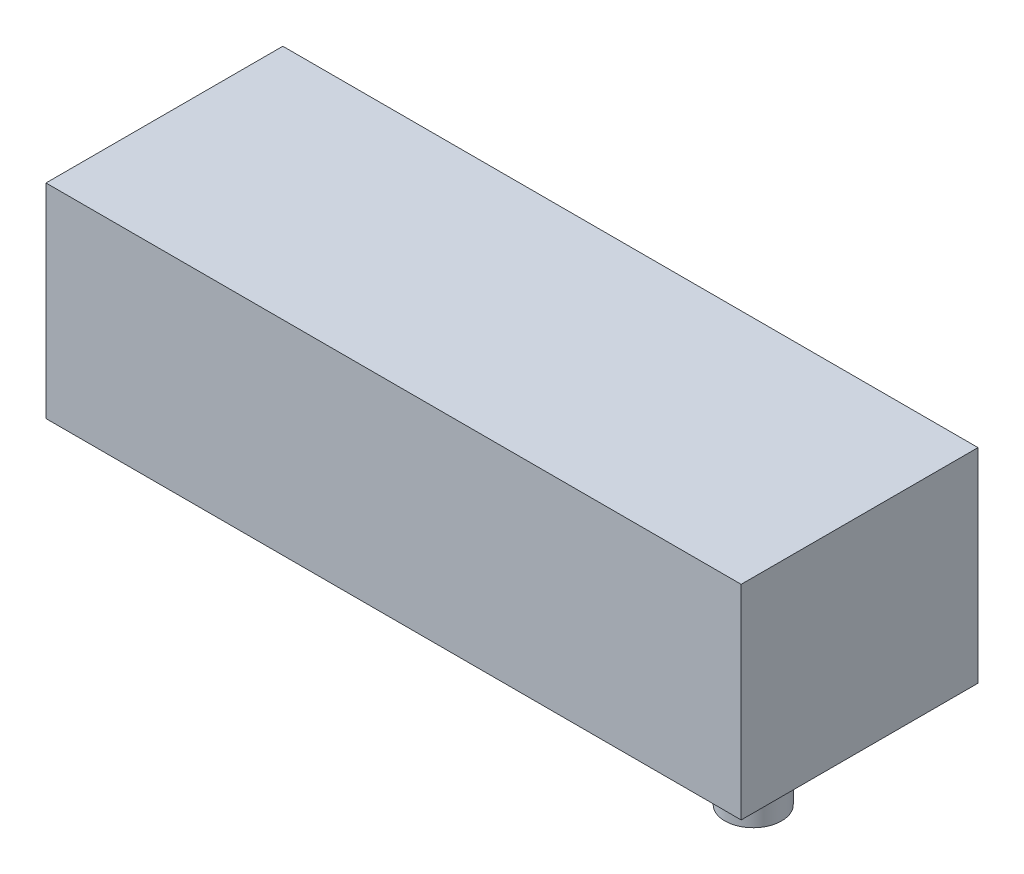
ISO-10303-21;
HEADER;
FILE_DESCRIPTION(('STEP AP214'),'2;1');
FILE_NAME('part.step','',(''),(''),'','','');
FILE_SCHEMA(('AUTOMOTIVE_DESIGN { 1 0 10303 214 1 1 1 1 }'));
ENDSEC;
DATA;
#1=APPLICATION_CONTEXT('core data for automotive mechanical design processes');
#2=APPLICATION_PROTOCOL_DEFINITION('international standard','automotive_design',2000,#1);
#3=PRODUCT_CONTEXT('',#1,'mechanical');
#4=PRODUCT('Part','Part','',(#3));
#5=PRODUCT_RELATED_PRODUCT_CATEGORY('part','',(#4));
#6=PRODUCT_DEFINITION_FORMATION('','',#4);
#7=PRODUCT_DEFINITION_CONTEXT('part definition',#1,'design');
#8=PRODUCT_DEFINITION('design','',#6,#7);
#9=PRODUCT_DEFINITION_SHAPE('','',#8);
#10=(LENGTH_UNIT() NAMED_UNIT(*) SI_UNIT(.MILLI.,.METRE.));
#11=(NAMED_UNIT(*) PLANE_ANGLE_UNIT() SI_UNIT($,.RADIAN.));
#12=(NAMED_UNIT(*) SI_UNIT($,.STERADIAN.) SOLID_ANGLE_UNIT());
#13=UNCERTAINTY_MEASURE_WITH_UNIT(LENGTH_MEASURE(1.E-05),#10,'distance_accuracy_value','');
#14=(GEOMETRIC_REPRESENTATION_CONTEXT(3) GLOBAL_UNCERTAINTY_ASSIGNED_CONTEXT((#13)) GLOBAL_UNIT_ASSIGNED_CONTEXT((#10,
#11,#12)) REPRESENTATION_CONTEXT('',''));
#15=CARTESIAN_POINT('',(0.,0.,0.));
#16=DIRECTION('',(0.,0.,1.));
#17=DIRECTION('',(1.,0.,0.));
#18=AXIS2_PLACEMENT_3D('',#15,#16,#17);
#19=CARTESIAN_POINT('',(0.,19.19,-22.27));
#20=DIRECTION('',(0.,-1.,0.));
#21=DIRECTION('',(0.,0.,-1.));
#22=AXIS2_PLACEMENT_3D('',#19,#20,#21);
#23=PLANE('',#22);
#24=DIRECTION('',(1.,0.,0.));
#25=VECTOR('',#24,1.);
#26=CARTESIAN_POINT('',(0.,19.19,0.));
#27=LINE('',#26,#25);
#28=CARTESIAN_POINT('',(0.,19.19,0.));
#29=VERTEX_POINT('',#28);
#30=CARTESIAN_POINT('',(65.37,19.19,0.));
#31=VERTEX_POINT('',#30);
#32=EDGE_CURVE('E95',#29,#31,#27,.T.);
#33=ORIENTED_EDGE('',*,*,#32,.T.);
#34=DIRECTION('',(0.,0.,1.));
#35=VECTOR('',#34,1.);
#36=CARTESIAN_POINT('',(65.37,19.19,-22.27));
#37=LINE('',#36,#35);
#38=CARTESIAN_POINT('',(65.37,19.19,-22.27));
#39=VERTEX_POINT('',#38);
#40=EDGE_CURVE('E11',#39,#31,#37,.T.);
#41=ORIENTED_EDGE('',*,*,#40,.F.);
#42=DIRECTION('',(1.,0.,0.));
#43=VECTOR('',#42,1.);
#44=CARTESIAN_POINT('',(0.,19.19,-22.27));
#45=LINE('',#44,#43);
#46=CARTESIAN_POINT('',(0.,19.19,-22.27));
#47=VERTEX_POINT('',#46);
#48=EDGE_CURVE('E72',#47,#39,#45,.T.);
#49=ORIENTED_EDGE('',*,*,#48,.F.);
#50=DIRECTION('',(0.,0.,1.));
#51=VECTOR('',#50,1.);
#52=CARTESIAN_POINT('',(0.,19.19,-22.27));
#53=LINE('',#52,#51);
#54=EDGE_CURVE('E91',#47,#29,#53,.T.);
#55=ORIENTED_EDGE('',*,*,#54,.T.);
#56=EDGE_LOOP('',(#33,#41,#49,#55));
#57=FACE_BOUND('',#56,.T.);
#58=ADVANCED_FACE('F33',(#57),#23,.F.);
#59=CARTESIAN_POINT('',(65.37,0.,-22.27));
#60=DIRECTION('',(1.,0.,0.));
#61=DIRECTION('',(0.,0.,-1.));
#62=AXIS2_PLACEMENT_3D('',#59,#60,#61);
#63=PLANE('',#62);
#64=DIRECTION('',(0.,1.,0.));
#65=VECTOR('',#64,1.);
#66=CARTESIAN_POINT('',(65.37,0.,0.));
#67=LINE('',#66,#65);
#68=CARTESIAN_POINT('',(65.37,0.,0.));
#69=VERTEX_POINT('',#68);
#70=EDGE_CURVE('E81',#69,#31,#67,.T.);
#71=ORIENTED_EDGE('',*,*,#70,.F.);
#72=DIRECTION('',(0.,0.,1.));
#73=VECTOR('',#72,1.);
#74=CARTESIAN_POINT('',(65.37,0.,-22.27));
#75=LINE('',#74,#73);
#76=CARTESIAN_POINT('',(65.37,0.,-22.27));
#77=VERTEX_POINT('',#76);
#78=EDGE_CURVE('E41',#77,#69,#75,.T.);
#79=ORIENTED_EDGE('',*,*,#78,.F.);
#80=DIRECTION('',(0.,1.,0.));
#81=VECTOR('',#80,1.);
#82=CARTESIAN_POINT('',(65.37,0.,-22.27));
#83=LINE('',#82,#81);
#84=EDGE_CURVE('E79',#77,#39,#83,.T.);
#85=ORIENTED_EDGE('',*,*,#84,.T.);
#86=ORIENTED_EDGE('',*,*,#40,.T.);
#87=EDGE_LOOP('',(#71,#79,#85,#86));
#88=FACE_BOUND('',#87,.T.);
#89=ADVANCED_FACE('F78',(#88),#63,.T.);
#90=CARTESIAN_POINT('',(0.,0.,-22.27));
#91=DIRECTION('',(0.,-1.,0.));
#92=DIRECTION('',(0.,0.,-1.));
#93=AXIS2_PLACEMENT_3D('',#90,#91,#92);
#94=PLANE('',#93);
#95=CARTESIAN_POINT('',(55.37,0.,-11.135));
#96=DIRECTION('',(0.,-1.,0.));
#97=DIRECTION('',(0.,0.,-1.));
#98=AXIS2_PLACEMENT_3D('',#95,#96,#97);
#99=CIRCLE('',#98,2.665);
#100=CARTESIAN_POINT('',(55.37,0.,-13.8));
#101=VERTEX_POINT('',#100);
#102=EDGE_CURVE('E169',#101,#101,#99,.T.);
#103=ORIENTED_EDGE('',*,*,#102,.F.);
#104=EDGE_LOOP('',(#103));
#105=FACE_BOUND('',#104,.T.);
#106=DIRECTION('',(1.,0.,0.));
#107=VECTOR('',#106,1.);
#108=CARTESIAN_POINT('',(0.,0.,0.));
#109=LINE('',#108,#107);
#110=CARTESIAN_POINT('',(0.,0.,0.));
#111=VERTEX_POINT('',#110);
#112=EDGE_CURVE('E100',#111,#69,#109,.T.);
#113=ORIENTED_EDGE('',*,*,#112,.F.);
#114=DIRECTION('',(0.,0.,1.));
#115=VECTOR('',#114,1.);
#116=CARTESIAN_POINT('',(0.,0.,-22.27));
#117=LINE('',#116,#115);
#118=CARTESIAN_POINT('',(0.,0.,-22.27));
#119=VERTEX_POINT('',#118);
#120=EDGE_CURVE('E64',#119,#111,#117,.T.);
#121=ORIENTED_EDGE('',*,*,#120,.F.);
#122=DIRECTION('',(1.,0.,0.));
#123=VECTOR('',#122,1.);
#124=CARTESIAN_POINT('',(0.,0.,-22.27));
#125=LINE('',#124,#123);
#126=EDGE_CURVE('E87',#119,#77,#125,.T.);
#127=ORIENTED_EDGE('',*,*,#126,.T.);
#128=ORIENTED_EDGE('',*,*,#78,.T.);
#129=EDGE_LOOP('',(#113,#121,#127,#128));
#130=FACE_BOUND('',#129,.T.);
#131=ADVANCED_FACE('F89',(#105,#130),#94,.T.);
#132=CARTESIAN_POINT('',(0.,0.,-22.27));
#133=DIRECTION('',(1.,0.,0.));
#134=DIRECTION('',(0.,0.,-1.));
#135=AXIS2_PLACEMENT_3D('',#132,#133,#134);
#136=PLANE('',#135);
#137=DIRECTION('',(0.,1.,0.));
#138=VECTOR('',#137,1.);
#139=CARTESIAN_POINT('',(0.,0.,0.));
#140=LINE('',#139,#138);
#141=EDGE_CURVE('E67',#111,#29,#140,.T.);
#142=ORIENTED_EDGE('',*,*,#141,.T.);
#143=ORIENTED_EDGE('',*,*,#54,.F.);
#144=DIRECTION('',(0.,1.,0.));
#145=VECTOR('',#144,1.);
#146=CARTESIAN_POINT('',(0.,0.,-22.27));
#147=LINE('',#146,#145);
#148=EDGE_CURVE('E49',#119,#47,#147,.T.);
#149=ORIENTED_EDGE('',*,*,#148,.F.);
#150=ORIENTED_EDGE('',*,*,#120,.T.);
#151=EDGE_LOOP('',(#142,#143,#149,#150));
#152=FACE_BOUND('',#151,.T.);
#153=ADVANCED_FACE('F118',(#152),#136,.F.);
#154=CARTESIAN_POINT('',(0.,0.,-22.27));
#155=DIRECTION('',(0.,0.,1.));
#156=DIRECTION('',(1.,0.,0.));
#157=AXIS2_PLACEMENT_3D('',#154,#155,#156);
#158=PLANE('',#157);
#159=ORIENTED_EDGE('',*,*,#48,.T.);
#160=ORIENTED_EDGE('',*,*,#84,.F.);
#161=ORIENTED_EDGE('',*,*,#126,.F.);
#162=ORIENTED_EDGE('',*,*,#148,.T.);
#163=EDGE_LOOP('',(#159,#160,#161,#162));
#164=FACE_BOUND('',#163,.T.);
#165=ADVANCED_FACE('F86',(#164),#158,.F.);
#166=CARTESIAN_POINT('',(0.,0.,0.));
#167=DIRECTION('',(0.,0.,1.));
#168=DIRECTION('',(1.,0.,0.));
#169=AXIS2_PLACEMENT_3D('',#166,#167,#168);
#170=PLANE('',#169);
#171=ORIENTED_EDGE('',*,*,#32,.F.);
#172=ORIENTED_EDGE('',*,*,#141,.F.);
#173=ORIENTED_EDGE('',*,*,#112,.T.);
#174=ORIENTED_EDGE('',*,*,#70,.T.);
#175=EDGE_LOOP('',(#171,#172,#173,#174));
#176=FACE_BOUND('',#175,.T.);
#177=ADVANCED_FACE('F107',(#176),#170,.T.);
#178=CARTESIAN_POINT('',(55.37,-9.32,-11.135));
#179=DIRECTION('',(0.,1.,0.));
#180=DIRECTION('',(0.,0.,1.));
#181=AXIS2_PLACEMENT_3D('',#178,#179,#180);
#182=CYLINDRICAL_SURFACE('',#181,2.665);
#183=CARTESIAN_POINT('',(55.37,-9.32,-11.135));
#184=DIRECTION('',(0.,-1.,0.));
#185=DIRECTION('',(0.,0.,-1.));
#186=AXIS2_PLACEMENT_3D('',#183,#184,#185);
#187=CIRCLE('',#186,2.665);
#188=CARTESIAN_POINT('',(55.37,-9.32,-13.8));
#189=VERTEX_POINT('',#188);
#190=EDGE_CURVE('E98',#189,#189,#187,.T.);
#191=ORIENTED_EDGE('',*,*,#190,.F.);
#192=EDGE_LOOP('',(#191));
#193=FACE_BOUND('',#192,.T.);
#194=ORIENTED_EDGE('',*,*,#102,.T.);
#195=EDGE_LOOP('',(#194));
#196=FACE_BOUND('',#195,.T.);
#197=ADVANCED_FACE('F109',(#193,#196),#182,.T.);
#198=CARTESIAN_POINT('',(55.37,-9.32,-11.135));
#199=DIRECTION('',(0.,-1.,0.));
#200=DIRECTION('',(0.,0.,-1.));
#201=AXIS2_PLACEMENT_3D('',#198,#199,#200);
#202=PLANE('',#201);
#203=ORIENTED_EDGE('',*,*,#190,.T.);
#204=EDGE_LOOP('',(#203));
#205=FACE_BOUND('',#204,.T.);
#206=ADVANCED_FACE('F115',(#205),#202,.T.);
#207=CLOSED_SHELL('',(#58,#89,#131,#153,#165,#177,#197,#206));
#208=MANIFOLD_SOLID_BREP('B2',#207);
#209=ADVANCED_BREP_SHAPE_REPRESENTATION('',(#18,#208),#14);
#210=SHAPE_DEFINITION_REPRESENTATION(#9,#209);
ENDSEC;
END-ISO-10303-21;
